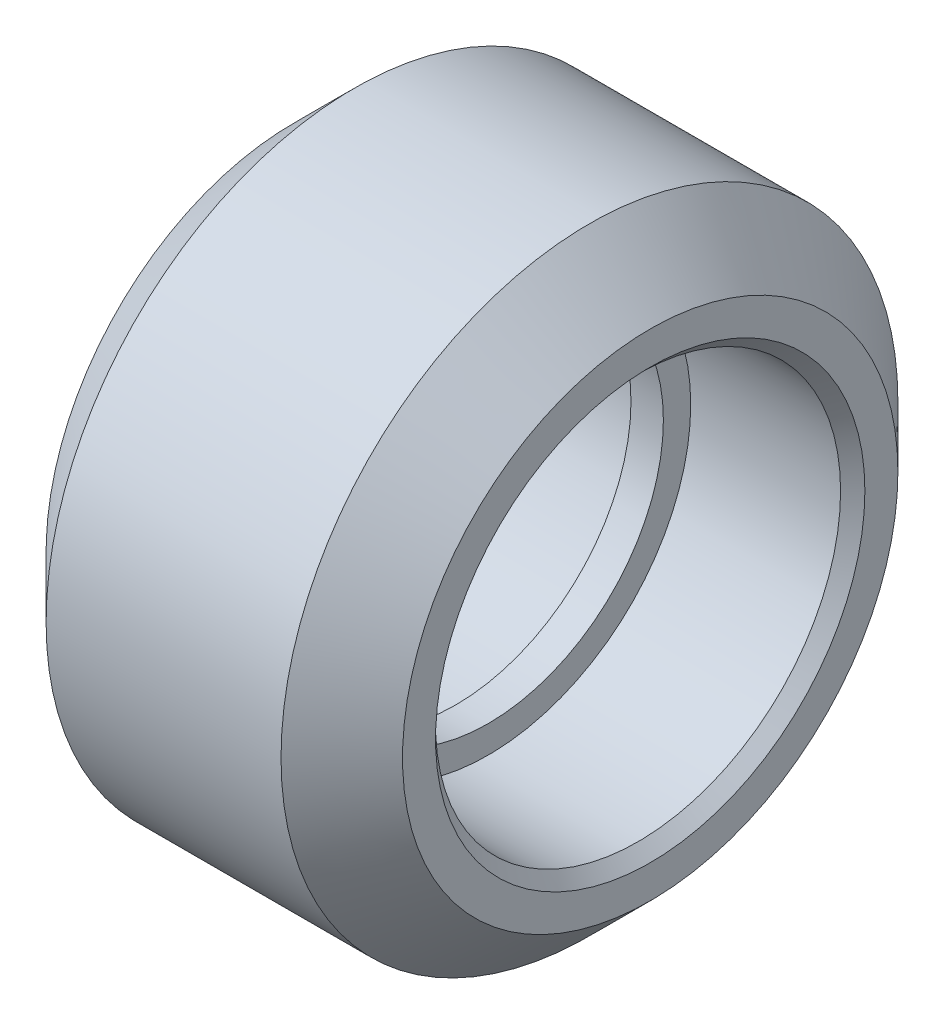
ISO-10303-21;
HEADER;
FILE_DESCRIPTION(('STEP AP214'),'2;1');
FILE_NAME('part.step','',(''),(''),'','','');
FILE_SCHEMA(('AUTOMOTIVE_DESIGN { 1 0 10303 214 1 1 1 1 }'));
ENDSEC;
DATA;
#1=APPLICATION_CONTEXT('core data for automotive mechanical design processes');
#2=APPLICATION_PROTOCOL_DEFINITION('international standard','automotive_design',2000,#1);
#3=PRODUCT_CONTEXT('',#1,'mechanical');
#4=PRODUCT('Part','Part','',(#3));
#5=PRODUCT_RELATED_PRODUCT_CATEGORY('part','',(#4));
#6=PRODUCT_DEFINITION_FORMATION('','',#4);
#7=PRODUCT_DEFINITION_CONTEXT('part definition',#1,'design');
#8=PRODUCT_DEFINITION('design','',#6,#7);
#9=PRODUCT_DEFINITION_SHAPE('','',#8);
#10=(LENGTH_UNIT() NAMED_UNIT(*) SI_UNIT(.MILLI.,.METRE.));
#11=(NAMED_UNIT(*) PLANE_ANGLE_UNIT() SI_UNIT($,.RADIAN.));
#12=(NAMED_UNIT(*) SI_UNIT($,.STERADIAN.) SOLID_ANGLE_UNIT());
#13=UNCERTAINTY_MEASURE_WITH_UNIT(LENGTH_MEASURE(1.E-05),#10,'distance_accuracy_value','');
#14=(GEOMETRIC_REPRESENTATION_CONTEXT(3) GLOBAL_UNCERTAINTY_ASSIGNED_CONTEXT((#13)) GLOBAL_UNIT_ASSIGNED_CONTEXT((#10,
#11,#12)) REPRESENTATION_CONTEXT('',''));
#15=CARTESIAN_POINT('',(0.,0.,0.));
#16=DIRECTION('',(0.,0.,1.));
#17=DIRECTION('',(1.,0.,0.));
#18=AXIS2_PLACEMENT_3D('',#15,#16,#17);
#19=CARTESIAN_POINT('',(-6.01159288433055,2.98961797233233,-1.37753923075934));
#20=DIRECTION('',(1.,0.,0.));
#21=DIRECTION('',(0.,0.,-1.));
#22=AXIS2_PLACEMENT_3D('',#19,#20,#21);
#23=PLANE('',#22);
#24=CARTESIAN_POINT('',(-6.01159288433055,2.98961797233233,-1.37753923075934));
#25=DIRECTION('',(1.,0.,0.));
#26=DIRECTION('',(0.,0.,-1.));
#27=AXIS2_PLACEMENT_3D('',#24,#25,#26);
#28=CIRCLE('',#27,5.3);
#29=CARTESIAN_POINT('',(-6.01159288433055,2.98961797233233,-6.67753923075934));
#30=VERTEX_POINT('',#29);
#31=EDGE_CURVE('E29',#30,#30,#28,.T.);
#32=ORIENTED_EDGE('',*,*,#31,.T.);
#33=EDGE_LOOP('',(#32));
#34=FACE_BOUND('',#33,.T.);
#35=CARTESIAN_POINT('',(-6.01159288433055,2.98961797233233,-1.37753923075934));
#36=DIRECTION('',(1.,0.,0.));
#37=DIRECTION('',(0.,0.,-1.));
#38=AXIS2_PLACEMENT_3D('',#35,#36,#37);
#39=CIRCLE('',#38,6.11499999999999);
#40=CARTESIAN_POINT('',(-6.01159288433055,2.98961797233233,-7.49253923075933));
#41=VERTEX_POINT('',#40);
#42=EDGE_CURVE('E37',#41,#41,#39,.F.);
#43=ORIENTED_EDGE('',*,*,#42,.T.);
#44=EDGE_LOOP('',(#43));
#45=FACE_BOUND('',#44,.T.);
#46=ADVANCED_FACE('F14',(#34,#45),#23,.F.);
#47=CARTESIAN_POINT('',(2.78840711566945,2.98961797233233,-1.37753923075934));
#48=DIRECTION('',(-1.,0.,0.));
#49=DIRECTION('',(0.,0.,1.));
#50=AXIS2_PLACEMENT_3D('',#47,#48,#49);
#51=CYLINDRICAL_SURFACE('',#50,7.615);
#52=CARTESIAN_POINT('',(-4.51159288433054,2.98961797233233,-1.37753923075934));
#53=DIRECTION('',(1.,0.,0.));
#54=DIRECTION('',(0.,0.,-1.));
#55=AXIS2_PLACEMENT_3D('',#52,#53,#54);
#56=CIRCLE('',#55,7.615);
#57=CARTESIAN_POINT('',(-4.51159288433054,2.98961797233233,-8.99253923075934));
#58=VERTEX_POINT('',#57);
#59=EDGE_CURVE('E40',#58,#58,#56,.T.);
#60=ORIENTED_EDGE('',*,*,#59,.T.);
#61=EDGE_LOOP('',(#60));
#62=FACE_BOUND('',#61,.T.);
#63=CARTESIAN_POINT('',(1.28840711566944,2.98961797233233,-1.37753923075934));
#64=DIRECTION('',(1.,0.,0.));
#65=DIRECTION('',(0.,0.,-1.));
#66=AXIS2_PLACEMENT_3D('',#63,#64,#65);
#67=CIRCLE('',#66,7.615);
#68=CARTESIAN_POINT('',(1.28840711566944,2.98961797233233,-8.99253923075934));
#69=VERTEX_POINT('',#68);
#70=EDGE_CURVE('E43',#69,#69,#67,.F.);
#71=ORIENTED_EDGE('',*,*,#70,.T.);
#72=EDGE_LOOP('',(#71));
#73=FACE_BOUND('',#72,.T.);
#74=ADVANCED_FACE('F76',(#62,#73),#51,.T.);
#75=CARTESIAN_POINT('',(2.78840711566945,2.98961797233233,-1.37753923075934));
#76=DIRECTION('',(1.,0.,0.));
#77=DIRECTION('',(0.,0.,-1.));
#78=AXIS2_PLACEMENT_3D('',#75,#76,#77);
#79=PLANE('',#78);
#80=CARTESIAN_POINT('',(2.78840711566945,2.98961797233233,-1.37753923075934));
#81=DIRECTION('',(1.,0.,0.));
#82=DIRECTION('',(0.,0.,-1.));
#83=AXIS2_PLACEMENT_3D('',#80,#81,#82);
#84=CIRCLE('',#83,5.3);
#85=CARTESIAN_POINT('',(2.78840711566945,2.98961797233233,-6.67753923075933));
#86=VERTEX_POINT('',#85);
#87=EDGE_CURVE('E9',#86,#86,#84,.F.);
#88=ORIENTED_EDGE('',*,*,#87,.T.);
#89=EDGE_LOOP('',(#88));
#90=FACE_BOUND('',#89,.T.);
#91=CARTESIAN_POINT('',(2.78840711566945,2.98961797233233,-1.37753923075934));
#92=DIRECTION('',(1.,0.,0.));
#93=DIRECTION('',(0.,0.,-1.));
#94=AXIS2_PLACEMENT_3D('',#91,#92,#93);
#95=CIRCLE('',#94,6.11499999999999);
#96=CARTESIAN_POINT('',(2.78840711566945,2.98961797233233,-7.49253923075933));
#97=VERTEX_POINT('',#96);
#98=EDGE_CURVE('E34',#97,#97,#95,.T.);
#99=ORIENTED_EDGE('',*,*,#98,.T.);
#100=EDGE_LOOP('',(#99));
#101=FACE_BOUND('',#100,.T.);
#102=ADVANCED_FACE('F70',(#90,#101),#79,.T.);
#103=CARTESIAN_POINT('',(-1.21159288433055,2.98961797233233,-1.37753923075934));
#104=DIRECTION('',(1.,0.,0.));
#105=DIRECTION('',(0.,0.,-1.));
#106=AXIS2_PLACEMENT_3D('',#103,#104,#105);
#107=CYLINDRICAL_SURFACE('',#106,5.);
#108=CARTESIAN_POINT('',(2.48840711566946,2.98961797233233,-1.37753923075934));
#109=DIRECTION('',(1.,0.,0.));
#110=DIRECTION('',(0.,0.,-1.));
#111=AXIS2_PLACEMENT_3D('',#108,#109,#110);
#112=CIRCLE('',#111,5.);
#113=CARTESIAN_POINT('',(2.48840711566946,2.98961797233233,-6.37753923075934));
#114=VERTEX_POINT('',#113);
#115=EDGE_CURVE('E21',#114,#114,#112,.T.);
#116=ORIENTED_EDGE('',*,*,#115,.T.);
#117=EDGE_LOOP('',(#116));
#118=FACE_BOUND('',#117,.T.);
#119=CARTESIAN_POINT('',(-1.21159288433055,2.98961797233233,-1.37753923075934));
#120=DIRECTION('',(1.,0.,0.));
#121=DIRECTION('',(0.,0.,-1.));
#122=AXIS2_PLACEMENT_3D('',#119,#120,#121);
#123=CIRCLE('',#122,5.);
#124=CARTESIAN_POINT('',(-1.21159288433055,2.98961797233233,-6.37753923075934));
#125=VERTEX_POINT('',#124);
#126=EDGE_CURVE('E46',#125,#125,#123,.T.);
#127=ORIENTED_EDGE('',*,*,#126,.F.);
#128=EDGE_LOOP('',(#127));
#129=FACE_BOUND('',#128,.T.);
#130=ADVANCED_FACE('F65',(#118,#129),#107,.F.);
#131=CARTESIAN_POINT('',(-1.21159288433055,2.98961797233233,-1.37753923075934));
#132=DIRECTION('',(1.,0.,0.));
#133=DIRECTION('',(0.,0.,-1.));
#134=AXIS2_PLACEMENT_3D('',#131,#132,#133);
#135=PLANE('',#134);
#136=CARTESIAN_POINT('',(-1.21159288433055,2.98961797233233,-1.37753923075934));
#137=DIRECTION('',(1.,0.,0.));
#138=DIRECTION('',(0.,0.,-1.));
#139=AXIS2_PLACEMENT_3D('',#136,#137,#138);
#140=CIRCLE('',#139,4.325);
#141=CARTESIAN_POINT('',(-1.21159288433055,2.98961797233233,-5.70253923075934));
#142=VERTEX_POINT('',#141);
#143=EDGE_CURVE('E51',#142,#142,#140,.T.);
#144=ORIENTED_EDGE('',*,*,#143,.F.);
#145=EDGE_LOOP('',(#144));
#146=FACE_BOUND('',#145,.T.);
#147=ORIENTED_EDGE('',*,*,#126,.T.);
#148=EDGE_LOOP('',(#147));
#149=FACE_BOUND('',#148,.T.);
#150=ADVANCED_FACE('F61',(#146,#149),#135,.T.);
#151=CARTESIAN_POINT('',(-2.01159288433055,2.98961797233233,-1.37753923075934));
#152=DIRECTION('',(-1.,0.,0.));
#153=DIRECTION('',(0.,0.,1.));
#154=AXIS2_PLACEMENT_3D('',#151,#152,#153);
#155=CYLINDRICAL_SURFACE('',#154,5.);
#156=CARTESIAN_POINT('',(-5.71159288433054,2.98961797233233,-1.37753923075934));
#157=DIRECTION('',(1.,0.,0.));
#158=DIRECTION('',(0.,0.,-1.));
#159=AXIS2_PLACEMENT_3D('',#156,#157,#158);
#160=CIRCLE('',#159,5.);
#161=CARTESIAN_POINT('',(-5.71159288433054,2.98961797233233,-6.37753923075934));
#162=VERTEX_POINT('',#161);
#163=EDGE_CURVE('E25',#162,#162,#160,.F.);
#164=ORIENTED_EDGE('',*,*,#163,.T.);
#165=EDGE_LOOP('',(#164));
#166=FACE_BOUND('',#165,.T.);
#167=CARTESIAN_POINT('',(-2.01159288433055,2.98961797233233,-1.37753923075934));
#168=DIRECTION('',(1.,0.,0.));
#169=DIRECTION('',(0.,0.,-1.));
#170=AXIS2_PLACEMENT_3D('',#167,#168,#169);
#171=CIRCLE('',#170,5.);
#172=CARTESIAN_POINT('',(-2.01159288433055,2.98961797233233,-6.37753923075934));
#173=VERTEX_POINT('',#172);
#174=EDGE_CURVE('E50',#173,#173,#171,.T.);
#175=ORIENTED_EDGE('',*,*,#174,.T.);
#176=EDGE_LOOP('',(#175));
#177=FACE_BOUND('',#176,.T.);
#178=ADVANCED_FACE('F64',(#166,#177),#155,.F.);
#179=CARTESIAN_POINT('',(-2.01159288433055,2.98961797233233,-1.37753923075934));
#180=DIRECTION('',(-1.,0.,0.));
#181=DIRECTION('',(0.,0.,-1.));
#182=AXIS2_PLACEMENT_3D('',#179,#180,#181);
#183=PLANE('',#182);
#184=CARTESIAN_POINT('',(-2.01159288433055,2.98961797233233,-1.37753923075934));
#185=DIRECTION('',(-1.,0.,0.));
#186=DIRECTION('',(0.,0.,1.));
#187=AXIS2_PLACEMENT_3D('',#184,#185,#186);
#188=CIRCLE('',#187,4.325);
#189=CARTESIAN_POINT('',(-2.01159288433055,2.98961797233233,2.94746076924066));
#190=VERTEX_POINT('',#189);
#191=EDGE_CURVE('E47',#190,#190,#188,.T.);
#192=ORIENTED_EDGE('',*,*,#191,.F.);
#193=EDGE_LOOP('',(#192));
#194=FACE_BOUND('',#193,.T.);
#195=ORIENTED_EDGE('',*,*,#174,.F.);
#196=EDGE_LOOP('',(#195));
#197=FACE_BOUND('',#196,.T.);
#198=ADVANCED_FACE('F108',(#194,#197),#183,.T.);
#199=CARTESIAN_POINT('',(-2.21159288433055,2.98961797233233,-1.37753923075934));
#200=DIRECTION('',(1.,0.,0.));
#201=DIRECTION('',(0.,0.,-1.));
#202=AXIS2_PLACEMENT_3D('',#199,#200,#201);
#203=CYLINDRICAL_SURFACE('',#202,4.325);
#204=ORIENTED_EDGE('',*,*,#191,.T.);
#205=EDGE_LOOP('',(#204));
#206=FACE_BOUND('',#205,.T.);
#207=ORIENTED_EDGE('',*,*,#143,.T.);
#208=EDGE_LOOP('',(#207));
#209=FACE_BOUND('',#208,.T.);
#210=ADVANCED_FACE('F59',(#206,#209),#203,.F.);
#211=CARTESIAN_POINT('',(-4.51159288433054,2.98961797233233,-1.37753923075934));
#212=DIRECTION('',(1.,0.,0.));
#213=DIRECTION('',(0.,0.,-1.));
#214=AXIS2_PLACEMENT_3D('',#211,#212,#213);
#215=CONICAL_SURFACE('',#214,7.615,0.785398163397448);
#216=ORIENTED_EDGE('',*,*,#42,.F.);
#217=EDGE_LOOP('',(#216));
#218=FACE_BOUND('',#217,.T.);
#219=ORIENTED_EDGE('',*,*,#59,.F.);
#220=EDGE_LOOP('',(#219));
#221=FACE_BOUND('',#220,.T.);
#222=ADVANCED_FACE('F88',(#218,#221),#215,.T.);
#223=CARTESIAN_POINT('',(2.78840711566945,2.98961797233233,-1.37753923075934));
#224=DIRECTION('',(-1.,0.,0.));
#225=DIRECTION('',(0.,0.,1.));
#226=AXIS2_PLACEMENT_3D('',#223,#224,#225);
#227=CONICAL_SURFACE('',#226,6.11499999999999,0.785398163397449);
#228=ORIENTED_EDGE('',*,*,#70,.F.);
#229=EDGE_LOOP('',(#228));
#230=FACE_BOUND('',#229,.T.);
#231=ORIENTED_EDGE('',*,*,#98,.F.);
#232=EDGE_LOOP('',(#231));
#233=FACE_BOUND('',#232,.T.);
#234=ADVANCED_FACE('F91',(#230,#233),#227,.T.);
#235=CARTESIAN_POINT('',(-6.01159288433055,2.98961797233233,-1.37753923075934));
#236=DIRECTION('',(-1.,0.,0.));
#237=DIRECTION('',(0.,0.,1.));
#238=AXIS2_PLACEMENT_3D('',#235,#236,#237);
#239=CONICAL_SURFACE('',#238,5.3,0.785398163397443);
#240=ORIENTED_EDGE('',*,*,#163,.F.);
#241=EDGE_LOOP('',(#240));
#242=FACE_BOUND('',#241,.T.);
#243=ORIENTED_EDGE('',*,*,#31,.F.);
#244=EDGE_LOOP('',(#243));
#245=FACE_BOUND('',#244,.T.);
#246=ADVANCED_FACE('F94',(#242,#245),#239,.F.);
#247=CARTESIAN_POINT('',(2.48840711566946,2.98961797233233,-1.37753923075934));
#248=DIRECTION('',(1.,0.,0.));
#249=DIRECTION('',(0.,0.,-1.));
#250=AXIS2_PLACEMENT_3D('',#247,#248,#249);
#251=CONICAL_SURFACE('',#250,5.,0.785398163397448);
#252=ORIENTED_EDGE('',*,*,#87,.F.);
#253=EDGE_LOOP('',(#252));
#254=FACE_BOUND('',#253,.T.);
#255=ORIENTED_EDGE('',*,*,#115,.F.);
#256=EDGE_LOOP('',(#255));
#257=FACE_BOUND('',#256,.T.);
#258=ADVANCED_FACE('F16',(#254,#257),#251,.F.);
#259=CLOSED_SHELL('',(#46,#74,#102,#130,#150,#178,#198,#210,#222,#234,#246,#258));
#260=MANIFOLD_SOLID_BREP('B1',#259);
#261=ADVANCED_BREP_SHAPE_REPRESENTATION('',(#18,#260),#14);
#262=SHAPE_DEFINITION_REPRESENTATION(#9,#261);
ENDSEC;
END-ISO-10303-21;
